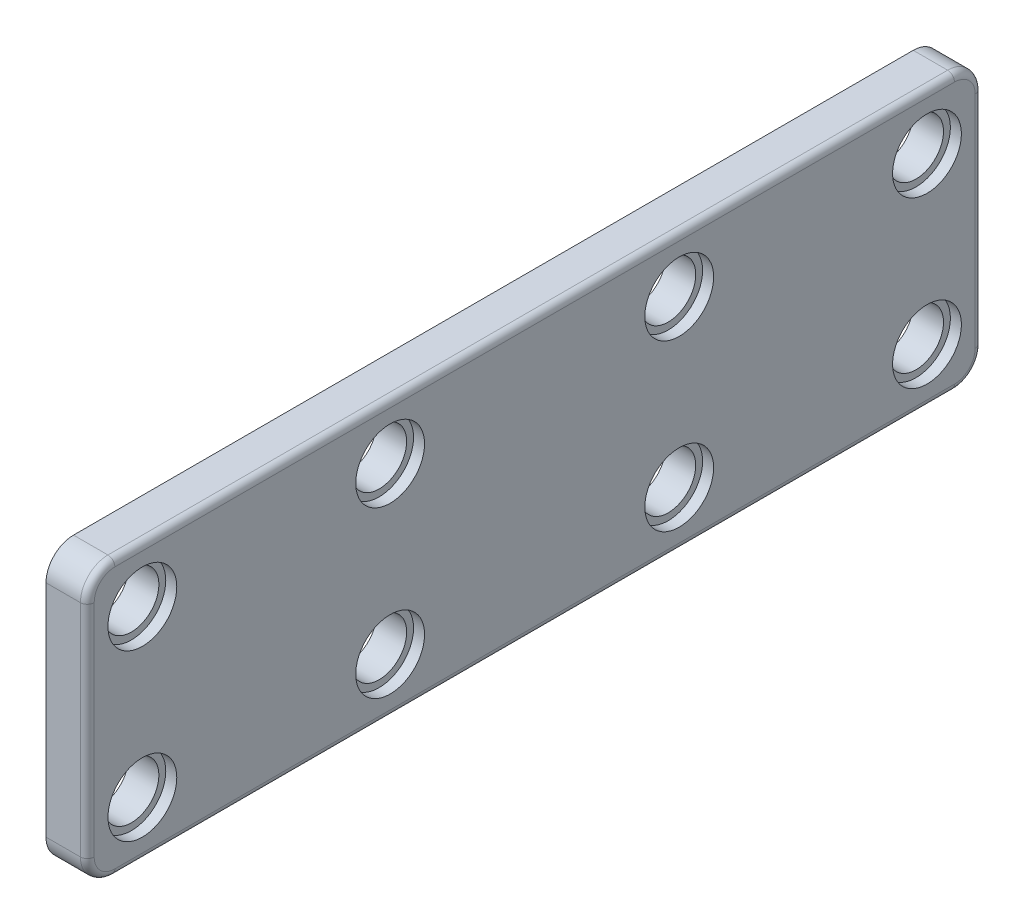
ISO-10303-21;
HEADER;
FILE_DESCRIPTION(('STEP AP214'),'2;1');
FILE_NAME('part.step','',(''),(''),'','','');
FILE_SCHEMA(('AUTOMOTIVE_DESIGN { 1 0 10303 214 1 1 1 1 }'));
ENDSEC;
DATA;
#1=APPLICATION_CONTEXT('core data for automotive mechanical design processes');
#2=APPLICATION_PROTOCOL_DEFINITION('international standard','automotive_design',2000,#1);
#3=PRODUCT_CONTEXT('',#1,'mechanical');
#4=PRODUCT('Part','Part','',(#3));
#5=PRODUCT_RELATED_PRODUCT_CATEGORY('part','',(#4));
#6=PRODUCT_DEFINITION_FORMATION('','',#4);
#7=PRODUCT_DEFINITION_CONTEXT('part definition',#1,'design');
#8=PRODUCT_DEFINITION('design','',#6,#7);
#9=PRODUCT_DEFINITION_SHAPE('','',#8);
#10=(LENGTH_UNIT() NAMED_UNIT(*) SI_UNIT(.MILLI.,.METRE.));
#11=(NAMED_UNIT(*) PLANE_ANGLE_UNIT() SI_UNIT($,.RADIAN.));
#12=(NAMED_UNIT(*) SI_UNIT($,.STERADIAN.) SOLID_ANGLE_UNIT());
#13=UNCERTAINTY_MEASURE_WITH_UNIT(LENGTH_MEASURE(1.E-05),#10,'distance_accuracy_value','');
#14=(GEOMETRIC_REPRESENTATION_CONTEXT(3) GLOBAL_UNCERTAINTY_ASSIGNED_CONTEXT((#13)) GLOBAL_UNIT_ASSIGNED_CONTEXT((#10,
#11,#12)) REPRESENTATION_CONTEXT('',''));
#15=CARTESIAN_POINT('',(0.,0.,0.));
#16=DIRECTION('',(0.,0.,1.));
#17=DIRECTION('',(1.,0.,0.));
#18=AXIS2_PLACEMENT_3D('',#15,#16,#17);
#19=CARTESIAN_POINT('',(1.5,-10.,65.));
#20=DIRECTION('',(-1.,0.,0.));
#21=DIRECTION('',(0.,0.,1.));
#22=AXIS2_PLACEMENT_3D('',#19,#20,#21);
#23=PLANE('',#22);
#24=DIRECTION('',(0.,1.,0.));
#25=VECTOR('',#24,1.);
#26=CARTESIAN_POINT('',(1.5,-10.,64.5));
#27=LINE('',#26,#25);
#28=CARTESIAN_POINT('',(1.5,8.,64.5));
#29=VERTEX_POINT('',#28);
#30=CARTESIAN_POINT('',(1.5,-8.,64.5));
#31=VERTEX_POINT('',#30);
#32=EDGE_CURVE('E232',#29,#31,#27,.F.);
#33=ORIENTED_EDGE('',*,*,#32,.T.);
#34=CARTESIAN_POINT('',(1.5,-8.,63.));
#35=DIRECTION('',(-1.,0.,0.));
#36=DIRECTION('',(0.,0.,1.));
#37=AXIS2_PLACEMENT_3D('',#34,#35,#36);
#38=CIRCLE('',#37,1.5);
#39=CARTESIAN_POINT('',(1.5,-9.5,63.));
#40=VERTEX_POINT('',#39);
#41=EDGE_CURVE('E234',#31,#40,#38,.F.);
#42=ORIENTED_EDGE('',*,*,#41,.T.);
#43=DIRECTION('',(0.,0.,-1.));
#44=VECTOR('',#43,1.);
#45=CARTESIAN_POINT('',(1.5,-9.5,65.));
#46=LINE('',#45,#44);
#47=CARTESIAN_POINT('',(1.5,-9.5,2.));
#48=VERTEX_POINT('',#47);
#49=EDGE_CURVE('E183',#40,#48,#46,.T.);
#50=ORIENTED_EDGE('',*,*,#49,.T.);
#51=CARTESIAN_POINT('',(1.5,-8.,2.));
#52=DIRECTION('',(-1.,0.,0.));
#53=DIRECTION('',(0.,0.,1.));
#54=AXIS2_PLACEMENT_3D('',#51,#52,#53);
#55=CIRCLE('',#54,1.5);
#56=CARTESIAN_POINT('',(1.5,-8.,0.500000000000002));
#57=VERTEX_POINT('',#56);
#58=EDGE_CURVE('E222',#48,#57,#55,.F.);
#59=ORIENTED_EDGE('',*,*,#58,.T.);
#60=DIRECTION('',(0.,1.,0.));
#61=VECTOR('',#60,1.);
#62=CARTESIAN_POINT('',(1.5,8.,0.5));
#63=LINE('',#62,#61);
#64=CARTESIAN_POINT('',(1.5,8.,0.5));
#65=VERTEX_POINT('',#64);
#66=EDGE_CURVE('E224',#57,#65,#63,.T.);
#67=ORIENTED_EDGE('',*,*,#66,.T.);
#68=CARTESIAN_POINT('',(1.5,8.,2.));
#69=DIRECTION('',(-1.,0.,0.));
#70=DIRECTION('',(0.,0.,1.));
#71=AXIS2_PLACEMENT_3D('',#68,#69,#70);
#72=CIRCLE('',#71,1.5);
#73=CARTESIAN_POINT('',(1.5,9.5,2.));
#74=VERTEX_POINT('',#73);
#75=EDGE_CURVE('E226',#65,#74,#72,.F.);
#76=ORIENTED_EDGE('',*,*,#75,.T.);
#77=DIRECTION('',(0.,0.,-1.));
#78=VECTOR('',#77,1.);
#79=CARTESIAN_POINT('',(1.5,9.5,65.));
#80=LINE('',#79,#78);
#81=CARTESIAN_POINT('',(1.5,9.5,63.));
#82=VERTEX_POINT('',#81);
#83=EDGE_CURVE('E228',#74,#82,#80,.F.);
#84=ORIENTED_EDGE('',*,*,#83,.T.);
#85=CARTESIAN_POINT('',(1.5,8.,63.));
#86=DIRECTION('',(-1.,0.,0.));
#87=DIRECTION('',(0.,0.,1.));
#88=AXIS2_PLACEMENT_3D('',#85,#86,#87);
#89=CIRCLE('',#88,1.5);
#90=EDGE_CURVE('E230',#82,#29,#89,.F.);
#91=ORIENTED_EDGE('',*,*,#90,.T.);
#92=EDGE_LOOP('',(#33,#42,#50,#59,#67,#76,#84,#91));
#93=FACE_BOUND('',#92,.T.);
#94=CARTESIAN_POINT('',(1.5,-6.,43.));
#95=DIRECTION('',(1.,0.,0.));
#96=DIRECTION('',(0.,0.,-1.));
#97=AXIS2_PLACEMENT_3D('',#94,#95,#96);
#98=CIRCLE('',#97,2.5);
#99=CARTESIAN_POINT('',(1.5,-6.,40.5));
#100=VERTEX_POINT('',#99);
#101=EDGE_CURVE('E204',#100,#100,#98,.T.);
#102=ORIENTED_EDGE('',*,*,#101,.F.);
#103=EDGE_LOOP('',(#102));
#104=FACE_BOUND('',#103,.T.);
#105=CARTESIAN_POINT('',(1.5,6.,61.));
#106=DIRECTION('',(1.,0.,0.));
#107=DIRECTION('',(0.,0.,-1.));
#108=AXIS2_PLACEMENT_3D('',#105,#106,#107);
#109=CIRCLE('',#108,2.5);
#110=CARTESIAN_POINT('',(1.5,6.,58.5));
#111=VERTEX_POINT('',#110);
#112=EDGE_CURVE('E189',#111,#111,#109,.T.);
#113=ORIENTED_EDGE('',*,*,#112,.F.);
#114=EDGE_LOOP('',(#113));
#115=FACE_BOUND('',#114,.T.);
#116=CARTESIAN_POINT('',(1.5,-6.,61.));
#117=DIRECTION('',(1.,0.,0.));
#118=DIRECTION('',(0.,0.,-1.));
#119=AXIS2_PLACEMENT_3D('',#116,#117,#118);
#120=CIRCLE('',#119,2.5);
#121=CARTESIAN_POINT('',(1.5,-6.,58.5));
#122=VERTEX_POINT('',#121);
#123=EDGE_CURVE('E194',#122,#122,#120,.T.);
#124=ORIENTED_EDGE('',*,*,#123,.F.);
#125=EDGE_LOOP('',(#124));
#126=FACE_BOUND('',#125,.T.);
#127=CARTESIAN_POINT('',(1.5,6.,43.));
#128=DIRECTION('',(1.,0.,0.));
#129=DIRECTION('',(0.,0.,-1.));
#130=AXIS2_PLACEMENT_3D('',#127,#128,#129);
#131=CIRCLE('',#130,2.5);
#132=CARTESIAN_POINT('',(1.5,6.,40.5));
#133=VERTEX_POINT('',#132);
#134=EDGE_CURVE('E199',#133,#133,#131,.T.);
#135=ORIENTED_EDGE('',*,*,#134,.F.);
#136=EDGE_LOOP('',(#135));
#137=FACE_BOUND('',#136,.T.);
#138=CARTESIAN_POINT('',(1.5,6.00000000000001,3.99999999999999));
#139=DIRECTION('',(1.,0.,0.));
#140=DIRECTION('',(0.,0.,-1.));
#141=AXIS2_PLACEMENT_3D('',#138,#139,#140);
#142=CIRCLE('',#141,2.49999999999999);
#143=CARTESIAN_POINT('',(1.5,6.00000000000001,1.5));
#144=VERTEX_POINT('',#143);
#145=EDGE_CURVE('E209',#144,#144,#142,.T.);
#146=ORIENTED_EDGE('',*,*,#145,.F.);
#147=EDGE_LOOP('',(#146));
#148=FACE_BOUND('',#147,.T.);
#149=CARTESIAN_POINT('',(1.5,-5.99999999999999,3.99999999999999));
#150=DIRECTION('',(1.,0.,0.));
#151=DIRECTION('',(0.,0.,-1.));
#152=AXIS2_PLACEMENT_3D('',#149,#150,#151);
#153=CIRCLE('',#152,2.5);
#154=CARTESIAN_POINT('',(1.5,-5.99999999999999,1.49999999999999));
#155=VERTEX_POINT('',#154);
#156=EDGE_CURVE('E214',#155,#155,#153,.T.);
#157=ORIENTED_EDGE('',*,*,#156,.F.);
#158=EDGE_LOOP('',(#157));
#159=FACE_BOUND('',#158,.T.);
#160=CARTESIAN_POINT('',(1.5,6.,22.));
#161=DIRECTION('',(1.,0.,0.));
#162=DIRECTION('',(0.,0.,-1.));
#163=AXIS2_PLACEMENT_3D('',#160,#161,#162);
#164=CIRCLE('',#163,2.5);
#165=CARTESIAN_POINT('',(1.5,6.,19.5));
#166=VERTEX_POINT('',#165);
#167=EDGE_CURVE('E219',#166,#166,#164,.T.);
#168=ORIENTED_EDGE('',*,*,#167,.F.);
#169=EDGE_LOOP('',(#168));
#170=FACE_BOUND('',#169,.T.);
#171=CARTESIAN_POINT('',(1.5,-6.,22.));
#172=DIRECTION('',(1.,0.,0.));
#173=DIRECTION('',(0.,0.,-1.));
#174=AXIS2_PLACEMENT_3D('',#171,#172,#173);
#175=CIRCLE('',#174,2.5);
#176=CARTESIAN_POINT('',(1.5,-6.,19.5));
#177=VERTEX_POINT('',#176);
#178=EDGE_CURVE('E270',#177,#177,#175,.T.);
#179=ORIENTED_EDGE('',*,*,#178,.F.);
#180=EDGE_LOOP('',(#179));
#181=FACE_BOUND('',#180,.T.);
#182=ADVANCED_FACE('F35',(#93,#104,#115,#126,#137,#148,#159,#170,#181),#23,.F.);
#183=CARTESIAN_POINT('',(-1.5,10.,65.));
#184=DIRECTION('',(0.,-1.,0.));
#185=DIRECTION('',(0.,0.,-1.));
#186=AXIS2_PLACEMENT_3D('',#183,#184,#185);
#187=PLANE('',#186);
#188=DIRECTION('',(-1.,0.,0.));
#189=VECTOR('',#188,1.);
#190=CARTESIAN_POINT('',(-1.5,10.,63.));
#191=LINE('',#190,#189);
#192=CARTESIAN_POINT('',(-1.5,10.,63.));
#193=VERTEX_POINT('',#192);
#194=CARTESIAN_POINT('',(1.,10.,63.));
#195=VERTEX_POINT('',#194);
#196=EDGE_CURVE('E143',#193,#195,#191,.F.);
#197=ORIENTED_EDGE('',*,*,#196,.T.);
#198=DIRECTION('',(0.,0.,-1.));
#199=VECTOR('',#198,1.);
#200=CARTESIAN_POINT('',(1.,10.,65.));
#201=LINE('',#200,#199);
#202=CARTESIAN_POINT('',(1.,10.,2.));
#203=VERTEX_POINT('',#202);
#204=EDGE_CURVE('E243',#195,#203,#201,.T.);
#205=ORIENTED_EDGE('',*,*,#204,.T.);
#206=DIRECTION('',(-1.,0.,0.));
#207=VECTOR('',#206,1.);
#208=CARTESIAN_POINT('',(-1.5,10.,2.));
#209=LINE('',#208,#207);
#210=CARTESIAN_POINT('',(-1.5,10.,2.));
#211=VERTEX_POINT('',#210);
#212=EDGE_CURVE('E171',#203,#211,#209,.T.);
#213=ORIENTED_EDGE('',*,*,#212,.T.);
#214=DIRECTION('',(0.,0.,-1.));
#215=VECTOR('',#214,1.);
#216=CARTESIAN_POINT('',(-1.5,10.,65.));
#217=LINE('',#216,#215);
#218=EDGE_CURVE('E138',#193,#211,#217,.T.);
#219=ORIENTED_EDGE('',*,*,#218,.F.);
#220=EDGE_LOOP('',(#197,#205,#213,#219));
#221=FACE_BOUND('',#220,.T.);
#222=ADVANCED_FACE('F352',(#221),#187,.F.);
#223=CARTESIAN_POINT('',(-1.5,-10.,65.));
#224=DIRECTION('',(1.,0.,0.));
#225=DIRECTION('',(0.,0.,-1.));
#226=AXIS2_PLACEMENT_3D('',#223,#224,#225);
#227=PLANE('',#226);
#228=CARTESIAN_POINT('',(-1.5,-6.,22.));
#229=DIRECTION('',(1.,0.,0.));
#230=DIRECTION('',(0.,0.,-1.));
#231=AXIS2_PLACEMENT_3D('',#228,#229,#230);
#232=CIRCLE('',#231,2.);
#233=CARTESIAN_POINT('',(-1.5,-6.,20.));
#234=VERTEX_POINT('',#233);
#235=EDGE_CURVE('E216',#234,#234,#232,.T.);
#236=ORIENTED_EDGE('',*,*,#235,.T.);
#237=EDGE_LOOP('',(#236));
#238=FACE_BOUND('',#237,.T.);
#239=CARTESIAN_POINT('',(-1.5,6.,22.));
#240=DIRECTION('',(1.,0.,0.));
#241=DIRECTION('',(0.,0.,-1.));
#242=AXIS2_PLACEMENT_3D('',#239,#240,#241);
#243=CIRCLE('',#242,2.);
#244=CARTESIAN_POINT('',(-1.5,6.,20.));
#245=VERTEX_POINT('',#244);
#246=EDGE_CURVE('E211',#245,#245,#243,.T.);
#247=ORIENTED_EDGE('',*,*,#246,.T.);
#248=EDGE_LOOP('',(#247));
#249=FACE_BOUND('',#248,.T.);
#250=CARTESIAN_POINT('',(-1.5,-5.99999999999999,3.99999999999999));
#251=DIRECTION('',(1.,0.,0.));
#252=DIRECTION('',(0.,0.,-1.));
#253=AXIS2_PLACEMENT_3D('',#250,#251,#252);
#254=CIRCLE('',#253,2.);
#255=CARTESIAN_POINT('',(-1.5,-5.99999999999999,1.99999999999999));
#256=VERTEX_POINT('',#255);
#257=EDGE_CURVE('E206',#256,#256,#254,.T.);
#258=ORIENTED_EDGE('',*,*,#257,.T.);
#259=EDGE_LOOP('',(#258));
#260=FACE_BOUND('',#259,.T.);
#261=CARTESIAN_POINT('',(-1.5,6.00000000000001,3.99999999999999));
#262=DIRECTION('',(1.,0.,0.));
#263=DIRECTION('',(0.,0.,-1.));
#264=AXIS2_PLACEMENT_3D('',#261,#262,#263);
#265=CIRCLE('',#264,2.);
#266=CARTESIAN_POINT('',(-1.5,6.00000000000001,1.99999999999999));
#267=VERTEX_POINT('',#266);
#268=EDGE_CURVE('E201',#267,#267,#265,.T.);
#269=ORIENTED_EDGE('',*,*,#268,.T.);
#270=EDGE_LOOP('',(#269));
#271=FACE_BOUND('',#270,.T.);
#272=CARTESIAN_POINT('',(-1.5,-6.,43.));
#273=DIRECTION('',(1.,0.,0.));
#274=DIRECTION('',(0.,0.,-1.));
#275=AXIS2_PLACEMENT_3D('',#272,#273,#274);
#276=CIRCLE('',#275,2.);
#277=CARTESIAN_POINT('',(-1.5,-6.,41.));
#278=VERTEX_POINT('',#277);
#279=EDGE_CURVE('E196',#278,#278,#276,.T.);
#280=ORIENTED_EDGE('',*,*,#279,.T.);
#281=EDGE_LOOP('',(#280));
#282=FACE_BOUND('',#281,.T.);
#283=CARTESIAN_POINT('',(-1.5,6.,43.));
#284=DIRECTION('',(1.,0.,0.));
#285=DIRECTION('',(0.,0.,-1.));
#286=AXIS2_PLACEMENT_3D('',#283,#284,#285);
#287=CIRCLE('',#286,2.);
#288=CARTESIAN_POINT('',(-1.5,6.,41.));
#289=VERTEX_POINT('',#288);
#290=EDGE_CURVE('E191',#289,#289,#287,.T.);
#291=ORIENTED_EDGE('',*,*,#290,.T.);
#292=EDGE_LOOP('',(#291));
#293=FACE_BOUND('',#292,.T.);
#294=CARTESIAN_POINT('',(-1.5,-6.,61.));
#295=DIRECTION('',(1.,0.,0.));
#296=DIRECTION('',(0.,0.,-1.));
#297=AXIS2_PLACEMENT_3D('',#294,#295,#296);
#298=CIRCLE('',#297,2.);
#299=CARTESIAN_POINT('',(-1.5,-6.,59.));
#300=VERTEX_POINT('',#299);
#301=EDGE_CURVE('E186',#300,#300,#298,.T.);
#302=ORIENTED_EDGE('',*,*,#301,.T.);
#303=EDGE_LOOP('',(#302));
#304=FACE_BOUND('',#303,.T.);
#305=CARTESIAN_POINT('',(-1.5,6.,61.));
#306=DIRECTION('',(1.,0.,0.));
#307=DIRECTION('',(0.,0.,-1.));
#308=AXIS2_PLACEMENT_3D('',#305,#306,#307);
#309=CIRCLE('',#308,2.);
#310=CARTESIAN_POINT('',(-1.5,6.,59.));
#311=VERTEX_POINT('',#310);
#312=EDGE_CURVE('E158',#311,#311,#309,.T.);
#313=ORIENTED_EDGE('',*,*,#312,.T.);
#314=EDGE_LOOP('',(#313));
#315=FACE_BOUND('',#314,.T.);
#316=DIRECTION('',(0.,-1.,0.));
#317=VECTOR('',#316,1.);
#318=CARTESIAN_POINT('',(-1.5,-10.,0.));
#319=LINE('',#318,#317);
#320=CARTESIAN_POINT('',(-1.5,8.,0.));
#321=VERTEX_POINT('',#320);
#322=CARTESIAN_POINT('',(-1.5,-8.,0.));
#323=VERTEX_POINT('',#322);
#324=EDGE_CURVE('E154',#321,#323,#319,.T.);
#325=ORIENTED_EDGE('',*,*,#324,.T.);
#326=CARTESIAN_POINT('',(-1.5,-8.,2.));
#327=DIRECTION('',(1.,0.,0.));
#328=DIRECTION('',(0.,0.,-1.));
#329=AXIS2_PLACEMENT_3D('',#326,#327,#328);
#330=CIRCLE('',#329,2.);
#331=CARTESIAN_POINT('',(-1.5,-10.,2.));
#332=VERTEX_POINT('',#331);
#333=EDGE_CURVE('E181',#323,#332,#330,.F.);
#334=ORIENTED_EDGE('',*,*,#333,.T.);
#335=DIRECTION('',(0.,0.,-1.));
#336=VECTOR('',#335,1.);
#337=CARTESIAN_POINT('',(-1.5,-10.,65.));
#338=LINE('',#337,#336);
#339=CARTESIAN_POINT('',(-1.5,-10.,63.));
#340=VERTEX_POINT('',#339);
#341=EDGE_CURVE('E153',#340,#332,#338,.T.);
#342=ORIENTED_EDGE('',*,*,#341,.F.);
#343=CARTESIAN_POINT('',(-1.5,-8.,63.));
#344=DIRECTION('',(1.,0.,0.));
#345=DIRECTION('',(0.,0.,-1.));
#346=AXIS2_PLACEMENT_3D('',#343,#344,#345);
#347=CIRCLE('',#346,2.);
#348=CARTESIAN_POINT('',(-1.5,-8.,65.));
#349=VERTEX_POINT('',#348);
#350=EDGE_CURVE('E152',#340,#349,#347,.F.);
#351=ORIENTED_EDGE('',*,*,#350,.T.);
#352=DIRECTION('',(0.,-1.,0.));
#353=VECTOR('',#352,1.);
#354=CARTESIAN_POINT('',(-1.5,-10.,65.));
#355=LINE('',#354,#353);
#356=CARTESIAN_POINT('',(-1.5,8.,65.));
#357=VERTEX_POINT('',#356);
#358=EDGE_CURVE('E131',#357,#349,#355,.T.);
#359=ORIENTED_EDGE('',*,*,#358,.F.);
#360=CARTESIAN_POINT('',(-1.5,8.,63.));
#361=DIRECTION('',(1.,0.,0.));
#362=DIRECTION('',(0.,0.,-1.));
#363=AXIS2_PLACEMENT_3D('',#360,#361,#362);
#364=CIRCLE('',#363,2.);
#365=EDGE_CURVE('E137',#357,#193,#364,.F.);
#366=ORIENTED_EDGE('',*,*,#365,.T.);
#367=ORIENTED_EDGE('',*,*,#218,.T.);
#368=CARTESIAN_POINT('',(-1.5,8.,2.));
#369=DIRECTION('',(1.,0.,0.));
#370=DIRECTION('',(0.,0.,-1.));
#371=AXIS2_PLACEMENT_3D('',#368,#369,#370);
#372=CIRCLE('',#371,2.);
#373=EDGE_CURVE('E173',#211,#321,#372,.F.);
#374=ORIENTED_EDGE('',*,*,#373,.T.);
#375=EDGE_LOOP('',(#325,#334,#342,#351,#359,#366,#367,#374));
#376=FACE_BOUND('',#375,.T.);
#377=ADVANCED_FACE('F149',(#238,#249,#260,#271,#282,#293,#304,#315,#376),#227,.F.);
#378=CARTESIAN_POINT('',(-1.5,-10.,65.));
#379=DIRECTION('',(0.,1.,0.));
#380=DIRECTION('',(0.,0.,1.));
#381=AXIS2_PLACEMENT_3D('',#378,#379,#380);
#382=PLANE('',#381);
#383=DIRECTION('',(1.,0.,0.));
#384=VECTOR('',#383,1.);
#385=CARTESIAN_POINT('',(1.5,-10.,2.));
#386=LINE('',#385,#384);
#387=CARTESIAN_POINT('',(1.,-10.,2.));
#388=VERTEX_POINT('',#387);
#389=EDGE_CURVE('E177',#332,#388,#386,.T.);
#390=ORIENTED_EDGE('',*,*,#389,.T.);
#391=DIRECTION('',(0.,0.,-1.));
#392=VECTOR('',#391,1.);
#393=CARTESIAN_POINT('',(1.,-10.,65.));
#394=LINE('',#393,#392);
#395=CARTESIAN_POINT('',(1.,-10.,63.));
#396=VERTEX_POINT('',#395);
#397=EDGE_CURVE('E11',#388,#396,#394,.F.);
#398=ORIENTED_EDGE('',*,*,#397,.T.);
#399=DIRECTION('',(1.,0.,0.));
#400=VECTOR('',#399,1.);
#401=CARTESIAN_POINT('',(-1.5,-10.,63.));
#402=LINE('',#401,#400);
#403=EDGE_CURVE('E168',#396,#340,#402,.F.);
#404=ORIENTED_EDGE('',*,*,#403,.T.);
#405=ORIENTED_EDGE('',*,*,#341,.T.);
#406=EDGE_LOOP('',(#390,#398,#404,#405));
#407=FACE_BOUND('',#406,.T.);
#408=ADVANCED_FACE('F421',(#407),#382,.F.);
#409=CARTESIAN_POINT('',(0.,0.,65.));
#410=DIRECTION('',(0.,0.,-1.));
#411=DIRECTION('',(-1.,0.,0.));
#412=AXIS2_PLACEMENT_3D('',#409,#410,#411);
#413=PLANE('',#412);
#414=DIRECTION('',(1.,0.,0.));
#415=VECTOR('',#414,1.);
#416=CARTESIAN_POINT('',(0.,-8.,65.));
#417=LINE('',#416,#415);
#418=CARTESIAN_POINT('',(1.,-8.,65.));
#419=VERTEX_POINT('',#418);
#420=EDGE_CURVE('E166',#349,#419,#417,.T.);
#421=ORIENTED_EDGE('',*,*,#420,.T.);
#422=DIRECTION('',(0.,1.,0.));
#423=VECTOR('',#422,1.);
#424=CARTESIAN_POINT('',(1.,0.,65.));
#425=LINE('',#424,#423);
#426=CARTESIAN_POINT('',(1.,8.,65.));
#427=VERTEX_POINT('',#426);
#428=EDGE_CURVE('E134',#419,#427,#425,.T.);
#429=ORIENTED_EDGE('',*,*,#428,.T.);
#430=DIRECTION('',(-1.,0.,0.));
#431=VECTOR('',#430,1.);
#432=CARTESIAN_POINT('',(0.,8.,65.));
#433=LINE('',#432,#431);
#434=EDGE_CURVE('E126',#427,#357,#433,.T.);
#435=ORIENTED_EDGE('',*,*,#434,.T.);
#436=ORIENTED_EDGE('',*,*,#358,.T.);
#437=EDGE_LOOP('',(#421,#429,#435,#436));
#438=FACE_BOUND('',#437,.T.);
#439=ADVANCED_FACE('F129',(#438),#413,.F.);
#440=CARTESIAN_POINT('',(0.,0.,0.));
#441=DIRECTION('',(0.,0.,-1.));
#442=DIRECTION('',(-1.,0.,0.));
#443=AXIS2_PLACEMENT_3D('',#440,#441,#442);
#444=PLANE('',#443);
#445=DIRECTION('',(-1.,0.,0.));
#446=VECTOR('',#445,1.);
#447=CARTESIAN_POINT('',(1.5,8.,0.));
#448=LINE('',#447,#446);
#449=CARTESIAN_POINT('',(1.,8.,0.));
#450=VERTEX_POINT('',#449);
#451=EDGE_CURVE('E175',#321,#450,#448,.F.);
#452=ORIENTED_EDGE('',*,*,#451,.T.);
#453=DIRECTION('',(0.,1.,0.));
#454=VECTOR('',#453,1.);
#455=CARTESIAN_POINT('',(1.,-8.,0.));
#456=LINE('',#455,#454);
#457=CARTESIAN_POINT('',(1.,-8.,0.));
#458=VERTEX_POINT('',#457);
#459=EDGE_CURVE('E59',#450,#458,#456,.F.);
#460=ORIENTED_EDGE('',*,*,#459,.T.);
#461=DIRECTION('',(1.,0.,0.));
#462=VECTOR('',#461,1.);
#463=CARTESIAN_POINT('',(-1.5,-8.,0.));
#464=LINE('',#463,#462);
#465=EDGE_CURVE('E179',#458,#323,#464,.F.);
#466=ORIENTED_EDGE('',*,*,#465,.T.);
#467=ORIENTED_EDGE('',*,*,#324,.F.);
#468=EDGE_LOOP('',(#452,#460,#466,#467));
#469=FACE_BOUND('',#468,.T.);
#470=ADVANCED_FACE('F366',(#469),#444,.T.);
#471=CARTESIAN_POINT('',(0.,8.,63.));
#472=DIRECTION('',(-1.,0.,0.));
#473=DIRECTION('',(0.,0.,1.));
#474=AXIS2_PLACEMENT_3D('',#471,#472,#473);
#475=CYLINDRICAL_SURFACE('',#474,2.);
#476=ORIENTED_EDGE('',*,*,#434,.F.);
#477=CARTESIAN_POINT('',(1.,8.,63.));
#478=DIRECTION('',(-1.,0.,0.));
#479=DIRECTION('',(0.,0.,1.));
#480=AXIS2_PLACEMENT_3D('',#477,#478,#479);
#481=CIRCLE('',#480,2.);
#482=EDGE_CURVE('E241',#427,#195,#481,.T.);
#483=ORIENTED_EDGE('',*,*,#482,.T.);
#484=ORIENTED_EDGE('',*,*,#196,.F.);
#485=ORIENTED_EDGE('',*,*,#365,.F.);
#486=EDGE_LOOP('',(#476,#483,#484,#485));
#487=FACE_BOUND('',#486,.T.);
#488=ADVANCED_FACE('F141',(#487),#475,.T.);
#489=CARTESIAN_POINT('',(0.,-8.,63.));
#490=DIRECTION('',(1.,0.,0.));
#491=DIRECTION('',(0.,0.,-1.));
#492=AXIS2_PLACEMENT_3D('',#489,#490,#491);
#493=CYLINDRICAL_SURFACE('',#492,2.);
#494=ORIENTED_EDGE('',*,*,#403,.F.);
#495=CARTESIAN_POINT('',(1.,-8.,63.));
#496=DIRECTION('',(-1.,0.,0.));
#497=DIRECTION('',(0.,0.,1.));
#498=AXIS2_PLACEMENT_3D('',#495,#496,#497);
#499=CIRCLE('',#498,2.);
#500=EDGE_CURVE('E237',#396,#419,#499,.T.);
#501=ORIENTED_EDGE('',*,*,#500,.T.);
#502=ORIENTED_EDGE('',*,*,#420,.F.);
#503=ORIENTED_EDGE('',*,*,#350,.F.);
#504=EDGE_LOOP('',(#494,#501,#502,#503));
#505=FACE_BOUND('',#504,.T.);
#506=ADVANCED_FACE('F365',(#505),#493,.T.);
#507=CARTESIAN_POINT('',(-1.5,8.,2.));
#508=DIRECTION('',(1.,0.,0.));
#509=DIRECTION('',(0.,0.,-1.));
#510=AXIS2_PLACEMENT_3D('',#507,#508,#509);
#511=CYLINDRICAL_SURFACE('',#510,2.);
#512=ORIENTED_EDGE('',*,*,#212,.F.);
#513=CARTESIAN_POINT('',(1.,8.,2.));
#514=DIRECTION('',(-1.,0.,0.));
#515=DIRECTION('',(0.,0.,1.));
#516=AXIS2_PLACEMENT_3D('',#513,#514,#515);
#517=CIRCLE('',#516,2.);
#518=EDGE_CURVE('E245',#203,#450,#517,.T.);
#519=ORIENTED_EDGE('',*,*,#518,.T.);
#520=ORIENTED_EDGE('',*,*,#451,.F.);
#521=ORIENTED_EDGE('',*,*,#373,.F.);
#522=EDGE_LOOP('',(#512,#519,#520,#521));
#523=FACE_BOUND('',#522,.T.);
#524=ADVANCED_FACE('F369',(#523),#511,.T.);
#525=CARTESIAN_POINT('',(-1.5,-8.,2.));
#526=DIRECTION('',(-1.,0.,0.));
#527=DIRECTION('',(0.,0.,1.));
#528=AXIS2_PLACEMENT_3D('',#525,#526,#527);
#529=CYLINDRICAL_SURFACE('',#528,2.);
#530=ORIENTED_EDGE('',*,*,#465,.F.);
#531=CARTESIAN_POINT('',(1.,-8.,2.));
#532=DIRECTION('',(-1.,0.,0.));
#533=DIRECTION('',(0.,0.,1.));
#534=AXIS2_PLACEMENT_3D('',#531,#532,#533);
#535=CIRCLE('',#534,2.);
#536=EDGE_CURVE('E44',#458,#388,#535,.T.);
#537=ORIENTED_EDGE('',*,*,#536,.T.);
#538=ORIENTED_EDGE('',*,*,#389,.F.);
#539=ORIENTED_EDGE('',*,*,#333,.F.);
#540=EDGE_LOOP('',(#530,#537,#538,#539));
#541=FACE_BOUND('',#540,.T.);
#542=ADVANCED_FACE('F349',(#541),#529,.T.);
#543=CARTESIAN_POINT('',(1.5,6.,61.));
#544=DIRECTION('',(1.,0.,0.));
#545=DIRECTION('',(0.,0.,-1.));
#546=AXIS2_PLACEMENT_3D('',#543,#544,#545);
#547=CYLINDRICAL_SURFACE('',#546,2.);
#548=CARTESIAN_POINT('',(0.700000000000001,6.,61.));
#549=DIRECTION('',(1.,0.,0.));
#550=DIRECTION('',(0.,0.,-1.));
#551=AXIS2_PLACEMENT_3D('',#548,#549,#550);
#552=CIRCLE('',#551,2.);
#553=CARTESIAN_POINT('',(0.700000000000001,6.,59.));
#554=VERTEX_POINT('',#553);
#555=EDGE_CURVE('E161',#554,#554,#552,.T.);
#556=ORIENTED_EDGE('',*,*,#555,.T.);
#557=EDGE_LOOP('',(#556));
#558=FACE_BOUND('',#557,.T.);
#559=ORIENTED_EDGE('',*,*,#312,.F.);
#560=EDGE_LOOP('',(#559));
#561=FACE_BOUND('',#560,.T.);
#562=ADVANCED_FACE('F335',(#558,#561),#547,.F.);
#563=CARTESIAN_POINT('',(0.700000000000001,8.,61.));
#564=DIRECTION('',(-1.,0.,0.));
#565=DIRECTION('',(0.,0.,1.));
#566=AXIS2_PLACEMENT_3D('',#563,#564,#565);
#567=PLANE('',#566);
#568=ORIENTED_EDGE('',*,*,#555,.F.);
#569=EDGE_LOOP('',(#568));
#570=FACE_BOUND('',#569,.T.);
#571=CARTESIAN_POINT('',(0.700000000000001,6.,61.));
#572=DIRECTION('',(1.,0.,0.));
#573=DIRECTION('',(0.,0.,-1.));
#574=AXIS2_PLACEMENT_3D('',#571,#572,#573);
#575=CIRCLE('',#574,2.5);
#576=CARTESIAN_POINT('',(0.700000000000001,6.,58.5));
#577=VERTEX_POINT('',#576);
#578=EDGE_CURVE('E328',#577,#577,#575,.T.);
#579=ORIENTED_EDGE('',*,*,#578,.T.);
#580=EDGE_LOOP('',(#579));
#581=FACE_BOUND('',#580,.T.);
#582=ADVANCED_FACE('F338',(#570,#581),#567,.F.);
#583=CARTESIAN_POINT('',(1.5,6.,61.));
#584=DIRECTION('',(1.,0.,0.));
#585=DIRECTION('',(0.,0.,-1.));
#586=AXIS2_PLACEMENT_3D('',#583,#584,#585);
#587=CYLINDRICAL_SURFACE('',#586,2.5);
#588=ORIENTED_EDGE('',*,*,#578,.F.);
#589=EDGE_LOOP('',(#588));
#590=FACE_BOUND('',#589,.T.);
#591=ORIENTED_EDGE('',*,*,#112,.T.);
#592=EDGE_LOOP('',(#591));
#593=FACE_BOUND('',#592,.T.);
#594=ADVANCED_FACE('F340',(#590,#593),#587,.F.);
#595=CARTESIAN_POINT('',(1.5,-6.,61.));
#596=DIRECTION('',(1.,0.,0.));
#597=DIRECTION('',(0.,0.,-1.));
#598=AXIS2_PLACEMENT_3D('',#595,#596,#597);
#599=CYLINDRICAL_SURFACE('',#598,2.);
#600=CARTESIAN_POINT('',(0.700000000000001,-6.,61.));
#601=DIRECTION('',(1.,0.,0.));
#602=DIRECTION('',(0.,0.,-1.));
#603=AXIS2_PLACEMENT_3D('',#600,#601,#602);
#604=CIRCLE('',#603,2.);
#605=CARTESIAN_POINT('',(0.700000000000001,-6.,59.));
#606=VERTEX_POINT('',#605);
#607=EDGE_CURVE('E190',#606,#606,#604,.T.);
#608=ORIENTED_EDGE('',*,*,#607,.T.);
#609=EDGE_LOOP('',(#608));
#610=FACE_BOUND('',#609,.T.);
#611=ORIENTED_EDGE('',*,*,#301,.F.);
#612=EDGE_LOOP('',(#611));
#613=FACE_BOUND('',#612,.T.);
#614=ADVANCED_FACE('F346',(#610,#613),#599,.F.);
#615=CARTESIAN_POINT('',(0.700000000000001,-4.,61.));
#616=DIRECTION('',(-1.,0.,0.));
#617=DIRECTION('',(0.,0.,1.));
#618=AXIS2_PLACEMENT_3D('',#615,#616,#617);
#619=PLANE('',#618);
#620=ORIENTED_EDGE('',*,*,#607,.F.);
#621=EDGE_LOOP('',(#620));
#622=FACE_BOUND('',#621,.T.);
#623=CARTESIAN_POINT('',(0.700000000000001,-6.,61.));
#624=DIRECTION('',(1.,0.,0.));
#625=DIRECTION('',(0.,0.,-1.));
#626=AXIS2_PLACEMENT_3D('',#623,#624,#625);
#627=CIRCLE('',#626,2.5);
#628=CARTESIAN_POINT('',(0.700000000000001,-6.,58.5));
#629=VERTEX_POINT('',#628);
#630=EDGE_CURVE('E322',#629,#629,#627,.T.);
#631=ORIENTED_EDGE('',*,*,#630,.T.);
#632=EDGE_LOOP('',(#631));
#633=FACE_BOUND('',#632,.T.);
#634=ADVANCED_FACE('F463',(#622,#633),#619,.F.);
#635=CARTESIAN_POINT('',(1.5,-6.,61.));
#636=DIRECTION('',(1.,0.,0.));
#637=DIRECTION('',(0.,0.,-1.));
#638=AXIS2_PLACEMENT_3D('',#635,#636,#637);
#639=CYLINDRICAL_SURFACE('',#638,2.5);
#640=ORIENTED_EDGE('',*,*,#630,.F.);
#641=EDGE_LOOP('',(#640));
#642=FACE_BOUND('',#641,.T.);
#643=ORIENTED_EDGE('',*,*,#123,.T.);
#644=EDGE_LOOP('',(#643));
#645=FACE_BOUND('',#644,.T.);
#646=ADVANCED_FACE('F469',(#642,#645),#639,.F.);
#647=CARTESIAN_POINT('',(1.5,6.,43.));
#648=DIRECTION('',(1.,0.,0.));
#649=DIRECTION('',(0.,0.,-1.));
#650=AXIS2_PLACEMENT_3D('',#647,#648,#649);
#651=CYLINDRICAL_SURFACE('',#650,2.);
#652=CARTESIAN_POINT('',(0.700000000000001,6.,43.));
#653=DIRECTION('',(1.,0.,0.));
#654=DIRECTION('',(0.,0.,-1.));
#655=AXIS2_PLACEMENT_3D('',#652,#653,#654);
#656=CIRCLE('',#655,2.);
#657=CARTESIAN_POINT('',(0.700000000000001,6.,41.));
#658=VERTEX_POINT('',#657);
#659=EDGE_CURVE('E195',#658,#658,#656,.T.);
#660=ORIENTED_EDGE('',*,*,#659,.T.);
#661=EDGE_LOOP('',(#660));
#662=FACE_BOUND('',#661,.T.);
#663=ORIENTED_EDGE('',*,*,#290,.F.);
#664=EDGE_LOOP('',(#663));
#665=FACE_BOUND('',#664,.T.);
#666=ADVANCED_FACE('F475',(#662,#665),#651,.F.);
#667=CARTESIAN_POINT('',(0.700000000000001,8.,43.));
#668=DIRECTION('',(-1.,0.,0.));
#669=DIRECTION('',(0.,0.,1.));
#670=AXIS2_PLACEMENT_3D('',#667,#668,#669);
#671=PLANE('',#670);
#672=ORIENTED_EDGE('',*,*,#659,.F.);
#673=EDGE_LOOP('',(#672));
#674=FACE_BOUND('',#673,.T.);
#675=CARTESIAN_POINT('',(0.700000000000001,6.,43.));
#676=DIRECTION('',(1.,0.,0.));
#677=DIRECTION('',(0.,0.,-1.));
#678=AXIS2_PLACEMENT_3D('',#675,#676,#677);
#679=CIRCLE('',#678,2.5);
#680=CARTESIAN_POINT('',(0.700000000000001,6.,40.5));
#681=VERTEX_POINT('',#680);
#682=EDGE_CURVE('E315',#681,#681,#679,.T.);
#683=ORIENTED_EDGE('',*,*,#682,.T.);
#684=EDGE_LOOP('',(#683));
#685=FACE_BOUND('',#684,.T.);
#686=ADVANCED_FACE('F479',(#674,#685),#671,.F.);
#687=CARTESIAN_POINT('',(1.5,6.,43.));
#688=DIRECTION('',(1.,0.,0.));
#689=DIRECTION('',(0.,0.,-1.));
#690=AXIS2_PLACEMENT_3D('',#687,#688,#689);
#691=CYLINDRICAL_SURFACE('',#690,2.5);
#692=ORIENTED_EDGE('',*,*,#682,.F.);
#693=EDGE_LOOP('',(#692));
#694=FACE_BOUND('',#693,.T.);
#695=ORIENTED_EDGE('',*,*,#134,.T.);
#696=EDGE_LOOP('',(#695));
#697=FACE_BOUND('',#696,.T.);
#698=ADVANCED_FACE('F483',(#694,#697),#691,.F.);
#699=CARTESIAN_POINT('',(1.5,-6.,43.));
#700=DIRECTION('',(1.,0.,0.));
#701=DIRECTION('',(0.,0.,-1.));
#702=AXIS2_PLACEMENT_3D('',#699,#700,#701);
#703=CYLINDRICAL_SURFACE('',#702,2.);
#704=CARTESIAN_POINT('',(0.700000000000001,-6.,43.));
#705=DIRECTION('',(1.,0.,0.));
#706=DIRECTION('',(0.,0.,-1.));
#707=AXIS2_PLACEMENT_3D('',#704,#705,#706);
#708=CIRCLE('',#707,2.);
#709=CARTESIAN_POINT('',(0.700000000000001,-6.,41.));
#710=VERTEX_POINT('',#709);
#711=EDGE_CURVE('E200',#710,#710,#708,.T.);
#712=ORIENTED_EDGE('',*,*,#711,.T.);
#713=EDGE_LOOP('',(#712));
#714=FACE_BOUND('',#713,.T.);
#715=ORIENTED_EDGE('',*,*,#279,.F.);
#716=EDGE_LOOP('',(#715));
#717=FACE_BOUND('',#716,.T.);
#718=ADVANCED_FACE('F487',(#714,#717),#703,.F.);
#719=CARTESIAN_POINT('',(0.700000000000001,-4.,43.));
#720=DIRECTION('',(-1.,0.,0.));
#721=DIRECTION('',(0.,0.,1.));
#722=AXIS2_PLACEMENT_3D('',#719,#720,#721);
#723=PLANE('',#722);
#724=ORIENTED_EDGE('',*,*,#711,.F.);
#725=EDGE_LOOP('',(#724));
#726=FACE_BOUND('',#725,.T.);
#727=CARTESIAN_POINT('',(0.700000000000001,-6.,43.));
#728=DIRECTION('',(1.,0.,0.));
#729=DIRECTION('',(0.,0.,-1.));
#730=AXIS2_PLACEMENT_3D('',#727,#728,#729);
#731=CIRCLE('',#730,2.5);
#732=CARTESIAN_POINT('',(0.700000000000001,-6.,40.5));
#733=VERTEX_POINT('',#732);
#734=EDGE_CURVE('E308',#733,#733,#731,.T.);
#735=ORIENTED_EDGE('',*,*,#734,.T.);
#736=EDGE_LOOP('',(#735));
#737=FACE_BOUND('',#736,.T.);
#738=ADVANCED_FACE('F491',(#726,#737),#723,.F.);
#739=CARTESIAN_POINT('',(1.5,-6.,43.));
#740=DIRECTION('',(1.,0.,0.));
#741=DIRECTION('',(0.,0.,-1.));
#742=AXIS2_PLACEMENT_3D('',#739,#740,#741);
#743=CYLINDRICAL_SURFACE('',#742,2.5);
#744=ORIENTED_EDGE('',*,*,#734,.F.);
#745=EDGE_LOOP('',(#744));
#746=FACE_BOUND('',#745,.T.);
#747=ORIENTED_EDGE('',*,*,#101,.T.);
#748=EDGE_LOOP('',(#747));
#749=FACE_BOUND('',#748,.T.);
#750=ADVANCED_FACE('F495',(#746,#749),#743,.F.);
#751=CARTESIAN_POINT('',(1.5,6.00000000000001,3.99999999999999));
#752=DIRECTION('',(1.,0.,0.));
#753=DIRECTION('',(0.,0.,-1.));
#754=AXIS2_PLACEMENT_3D('',#751,#752,#753);
#755=CYLINDRICAL_SURFACE('',#754,2.);
#756=CARTESIAN_POINT('',(0.700000000000001,6.00000000000001,3.99999999999999));
#757=DIRECTION('',(1.,0.,0.));
#758=DIRECTION('',(0.,0.,-1.));
#759=AXIS2_PLACEMENT_3D('',#756,#757,#758);
#760=CIRCLE('',#759,2.);
#761=CARTESIAN_POINT('',(0.700000000000001,6.00000000000001,1.99999999999999));
#762=VERTEX_POINT('',#761);
#763=EDGE_CURVE('E205',#762,#762,#760,.T.);
#764=ORIENTED_EDGE('',*,*,#763,.T.);
#765=EDGE_LOOP('',(#764));
#766=FACE_BOUND('',#765,.T.);
#767=ORIENTED_EDGE('',*,*,#268,.F.);
#768=EDGE_LOOP('',(#767));
#769=FACE_BOUND('',#768,.T.);
#770=ADVANCED_FACE('F499',(#766,#769),#755,.F.);
#771=CARTESIAN_POINT('',(0.700000000000001,8.00000000000001,3.99999999999999));
#772=DIRECTION('',(-1.,0.,0.));
#773=DIRECTION('',(0.,0.,1.));
#774=AXIS2_PLACEMENT_3D('',#771,#772,#773);
#775=PLANE('',#774);
#776=ORIENTED_EDGE('',*,*,#763,.F.);
#777=EDGE_LOOP('',(#776));
#778=FACE_BOUND('',#777,.T.);
#779=CARTESIAN_POINT('',(0.700000000000001,6.00000000000001,3.99999999999999));
#780=DIRECTION('',(1.,0.,0.));
#781=DIRECTION('',(0.,0.,-1.));
#782=AXIS2_PLACEMENT_3D('',#779,#780,#781);
#783=CIRCLE('',#782,2.5);
#784=CARTESIAN_POINT('',(0.700000000000001,6.00000000000001,1.49999999999999));
#785=VERTEX_POINT('',#784);
#786=EDGE_CURVE('E301',#785,#785,#783,.T.);
#787=ORIENTED_EDGE('',*,*,#786,.T.);
#788=EDGE_LOOP('',(#787));
#789=FACE_BOUND('',#788,.T.);
#790=ADVANCED_FACE('F503',(#778,#789),#775,.F.);
#791=CARTESIAN_POINT('',(1.5,6.00000000000001,3.99999999999999));
#792=DIRECTION('',(1.,0.,0.));
#793=DIRECTION('',(0.,0.,-1.));
#794=AXIS2_PLACEMENT_3D('',#791,#792,#793);
#795=CYLINDRICAL_SURFACE('',#794,2.5);
#796=ORIENTED_EDGE('',*,*,#786,.F.);
#797=EDGE_LOOP('',(#796));
#798=FACE_BOUND('',#797,.T.);
#799=ORIENTED_EDGE('',*,*,#145,.T.);
#800=EDGE_LOOP('',(#799));
#801=FACE_BOUND('',#800,.T.);
#802=ADVANCED_FACE('F507',(#798,#801),#795,.F.);
#803=CARTESIAN_POINT('',(1.5,-5.99999999999999,3.99999999999999));
#804=DIRECTION('',(1.,0.,0.));
#805=DIRECTION('',(0.,0.,-1.));
#806=AXIS2_PLACEMENT_3D('',#803,#804,#805);
#807=CYLINDRICAL_SURFACE('',#806,2.);
#808=CARTESIAN_POINT('',(0.700000000000001,-5.99999999999999,3.99999999999999));
#809=DIRECTION('',(1.,0.,0.));
#810=DIRECTION('',(0.,0.,-1.));
#811=AXIS2_PLACEMENT_3D('',#808,#809,#810);
#812=CIRCLE('',#811,2.);
#813=CARTESIAN_POINT('',(0.700000000000001,-5.99999999999999,1.99999999999999));
#814=VERTEX_POINT('',#813);
#815=EDGE_CURVE('E210',#814,#814,#812,.T.);
#816=ORIENTED_EDGE('',*,*,#815,.T.);
#817=EDGE_LOOP('',(#816));
#818=FACE_BOUND('',#817,.T.);
#819=ORIENTED_EDGE('',*,*,#257,.F.);
#820=EDGE_LOOP('',(#819));
#821=FACE_BOUND('',#820,.T.);
#822=ADVANCED_FACE('F511',(#818,#821),#807,.F.);
#823=CARTESIAN_POINT('',(0.700000000000001,-3.99999999999999,3.99999999999999));
#824=DIRECTION('',(-1.,0.,0.));
#825=DIRECTION('',(0.,0.,1.));
#826=AXIS2_PLACEMENT_3D('',#823,#824,#825);
#827=PLANE('',#826);
#828=ORIENTED_EDGE('',*,*,#815,.F.);
#829=EDGE_LOOP('',(#828));
#830=FACE_BOUND('',#829,.T.);
#831=CARTESIAN_POINT('',(0.700000000000001,-5.99999999999999,3.99999999999999));
#832=DIRECTION('',(1.,0.,0.));
#833=DIRECTION('',(0.,0.,-1.));
#834=AXIS2_PLACEMENT_3D('',#831,#832,#833);
#835=CIRCLE('',#834,2.5);
#836=CARTESIAN_POINT('',(0.700000000000001,-5.99999999999999,1.49999999999999));
#837=VERTEX_POINT('',#836);
#838=EDGE_CURVE('E294',#837,#837,#835,.T.);
#839=ORIENTED_EDGE('',*,*,#838,.T.);
#840=EDGE_LOOP('',(#839));
#841=FACE_BOUND('',#840,.T.);
#842=ADVANCED_FACE('F515',(#830,#841),#827,.F.);
#843=CARTESIAN_POINT('',(1.5,-5.99999999999999,3.99999999999999));
#844=DIRECTION('',(1.,0.,0.));
#845=DIRECTION('',(0.,0.,-1.));
#846=AXIS2_PLACEMENT_3D('',#843,#844,#845);
#847=CYLINDRICAL_SURFACE('',#846,2.5);
#848=ORIENTED_EDGE('',*,*,#838,.F.);
#849=EDGE_LOOP('',(#848));
#850=FACE_BOUND('',#849,.T.);
#851=ORIENTED_EDGE('',*,*,#156,.T.);
#852=EDGE_LOOP('',(#851));
#853=FACE_BOUND('',#852,.T.);
#854=ADVANCED_FACE('F519',(#850,#853),#847,.F.);
#855=CARTESIAN_POINT('',(1.5,6.,22.));
#856=DIRECTION('',(1.,0.,0.));
#857=DIRECTION('',(0.,0.,-1.));
#858=AXIS2_PLACEMENT_3D('',#855,#856,#857);
#859=CYLINDRICAL_SURFACE('',#858,2.);
#860=CARTESIAN_POINT('',(0.700000000000001,6.,22.));
#861=DIRECTION('',(1.,0.,0.));
#862=DIRECTION('',(0.,0.,-1.));
#863=AXIS2_PLACEMENT_3D('',#860,#861,#862);
#864=CIRCLE('',#863,2.);
#865=CARTESIAN_POINT('',(0.700000000000001,6.,20.));
#866=VERTEX_POINT('',#865);
#867=EDGE_CURVE('E215',#866,#866,#864,.T.);
#868=ORIENTED_EDGE('',*,*,#867,.T.);
#869=EDGE_LOOP('',(#868));
#870=FACE_BOUND('',#869,.T.);
#871=ORIENTED_EDGE('',*,*,#246,.F.);
#872=EDGE_LOOP('',(#871));
#873=FACE_BOUND('',#872,.T.);
#874=ADVANCED_FACE('F523',(#870,#873),#859,.F.);
#875=CARTESIAN_POINT('',(0.700000000000001,8.,22.));
#876=DIRECTION('',(-1.,0.,0.));
#877=DIRECTION('',(0.,0.,1.));
#878=AXIS2_PLACEMENT_3D('',#875,#876,#877);
#879=PLANE('',#878);
#880=ORIENTED_EDGE('',*,*,#867,.F.);
#881=EDGE_LOOP('',(#880));
#882=FACE_BOUND('',#881,.T.);
#883=CARTESIAN_POINT('',(0.700000000000001,6.,22.));
#884=DIRECTION('',(1.,0.,0.));
#885=DIRECTION('',(0.,0.,-1.));
#886=AXIS2_PLACEMENT_3D('',#883,#884,#885);
#887=CIRCLE('',#886,2.5);
#888=CARTESIAN_POINT('',(0.700000000000001,6.,19.5));
#889=VERTEX_POINT('',#888);
#890=EDGE_CURVE('E287',#889,#889,#887,.T.);
#891=ORIENTED_EDGE('',*,*,#890,.T.);
#892=EDGE_LOOP('',(#891));
#893=FACE_BOUND('',#892,.T.);
#894=ADVANCED_FACE('F527',(#882,#893),#879,.F.);
#895=CARTESIAN_POINT('',(1.5,6.,22.));
#896=DIRECTION('',(1.,0.,0.));
#897=DIRECTION('',(0.,0.,-1.));
#898=AXIS2_PLACEMENT_3D('',#895,#896,#897);
#899=CYLINDRICAL_SURFACE('',#898,2.5);
#900=ORIENTED_EDGE('',*,*,#890,.F.);
#901=EDGE_LOOP('',(#900));
#902=FACE_BOUND('',#901,.T.);
#903=ORIENTED_EDGE('',*,*,#167,.T.);
#904=EDGE_LOOP('',(#903));
#905=FACE_BOUND('',#904,.T.);
#906=ADVANCED_FACE('F531',(#902,#905),#899,.F.);
#907=CARTESIAN_POINT('',(1.5,-6.,22.));
#908=DIRECTION('',(1.,0.,0.));
#909=DIRECTION('',(0.,0.,-1.));
#910=AXIS2_PLACEMENT_3D('',#907,#908,#909);
#911=CYLINDRICAL_SURFACE('',#910,2.);
#912=CARTESIAN_POINT('',(0.700000000000001,-6.,22.));
#913=DIRECTION('',(1.,0.,0.));
#914=DIRECTION('',(0.,0.,-1.));
#915=AXIS2_PLACEMENT_3D('',#912,#913,#914);
#916=CIRCLE('',#915,2.);
#917=CARTESIAN_POINT('',(0.700000000000001,-6.,20.));
#918=VERTEX_POINT('',#917);
#919=EDGE_CURVE('E220',#918,#918,#916,.T.);
#920=ORIENTED_EDGE('',*,*,#919,.T.);
#921=EDGE_LOOP('',(#920));
#922=FACE_BOUND('',#921,.T.);
#923=ORIENTED_EDGE('',*,*,#235,.F.);
#924=EDGE_LOOP('',(#923));
#925=FACE_BOUND('',#924,.T.);
#926=ADVANCED_FACE('F535',(#922,#925),#911,.F.);
#927=CARTESIAN_POINT('',(0.700000000000001,-4.,22.));
#928=DIRECTION('',(-1.,0.,0.));
#929=DIRECTION('',(0.,0.,1.));
#930=AXIS2_PLACEMENT_3D('',#927,#928,#929);
#931=PLANE('',#930);
#932=ORIENTED_EDGE('',*,*,#919,.F.);
#933=EDGE_LOOP('',(#932));
#934=FACE_BOUND('',#933,.T.);
#935=CARTESIAN_POINT('',(0.700000000000001,-6.,22.));
#936=DIRECTION('',(1.,0.,0.));
#937=DIRECTION('',(0.,0.,-1.));
#938=AXIS2_PLACEMENT_3D('',#935,#936,#937);
#939=CIRCLE('',#938,2.5);
#940=CARTESIAN_POINT('',(0.700000000000001,-6.,19.5));
#941=VERTEX_POINT('',#940);
#942=EDGE_CURVE('E276',#941,#941,#939,.T.);
#943=ORIENTED_EDGE('',*,*,#942,.T.);
#944=EDGE_LOOP('',(#943));
#945=FACE_BOUND('',#944,.T.);
#946=ADVANCED_FACE('F408',(#934,#945),#931,.F.);
#947=CARTESIAN_POINT('',(1.5,-6.,22.));
#948=DIRECTION('',(1.,0.,0.));
#949=DIRECTION('',(0.,0.,-1.));
#950=AXIS2_PLACEMENT_3D('',#947,#948,#949);
#951=CYLINDRICAL_SURFACE('',#950,2.5);
#952=ORIENTED_EDGE('',*,*,#942,.F.);
#953=EDGE_LOOP('',(#952));
#954=FACE_BOUND('',#953,.T.);
#955=ORIENTED_EDGE('',*,*,#178,.T.);
#956=EDGE_LOOP('',(#955));
#957=FACE_BOUND('',#956,.T.);
#958=ADVANCED_FACE('F403',(#954,#957),#951,.F.);
#959=CARTESIAN_POINT('',(1.,8.,2.));
#960=DIRECTION('',(-1.,0.,0.));
#961=DIRECTION('',(0.,0.,1.));
#962=AXIS2_PLACEMENT_3D('',#959,#960,#961);
#963=TOROIDAL_SURFACE('',#962,1.5,0.5);
#964=CARTESIAN_POINT('',(1.,8.,0.500000000000002));
#965=DIRECTION('',(0.,-1.,0.));
#966=DIRECTION('',(0.,0.,-1.));
#967=AXIS2_PLACEMENT_3D('',#964,#965,#966);
#968=CIRCLE('',#967,0.5);
#969=EDGE_CURVE('E264',#450,#65,#968,.T.);
#970=ORIENTED_EDGE('',*,*,#969,.F.);
#971=ORIENTED_EDGE('',*,*,#518,.F.);
#972=CARTESIAN_POINT('',(1.,9.5,2.));
#973=DIRECTION('',(0.,0.,1.));
#974=DIRECTION('',(1.,0.,0.));
#975=AXIS2_PLACEMENT_3D('',#972,#973,#974);
#976=CIRCLE('',#975,0.5);
#977=EDGE_CURVE('E39',#74,#203,#976,.T.);
#978=ORIENTED_EDGE('',*,*,#977,.F.);
#979=ORIENTED_EDGE('',*,*,#75,.F.);
#980=EDGE_LOOP('',(#970,#971,#978,#979));
#981=FACE_BOUND('',#980,.T.);
#982=ADVANCED_FACE('F37',(#981),#963,.T.);
#983=CARTESIAN_POINT('',(1.,9.5,65.));
#984=DIRECTION('',(0.,0.,-1.));
#985=DIRECTION('',(-1.,0.,0.));
#986=AXIS2_PLACEMENT_3D('',#983,#984,#985);
#987=CYLINDRICAL_SURFACE('',#986,0.5);
#988=ORIENTED_EDGE('',*,*,#977,.T.);
#989=ORIENTED_EDGE('',*,*,#204,.F.);
#990=CARTESIAN_POINT('',(1.,9.5,63.));
#991=DIRECTION('',(0.,0.,1.));
#992=DIRECTION('',(1.,0.,0.));
#993=AXIS2_PLACEMENT_3D('',#990,#991,#992);
#994=CIRCLE('',#993,0.5);
#995=EDGE_CURVE('E262',#82,#195,#994,.T.);
#996=ORIENTED_EDGE('',*,*,#995,.F.);
#997=ORIENTED_EDGE('',*,*,#83,.F.);
#998=EDGE_LOOP('',(#988,#989,#996,#997));
#999=FACE_BOUND('',#998,.T.);
#1000=ADVANCED_FACE('F398',(#999),#987,.T.);
#1001=CARTESIAN_POINT('',(1.,-10.,0.5));
#1002=DIRECTION('',(0.,-1.,0.));
#1003=DIRECTION('',(0.,0.,-1.));
#1004=AXIS2_PLACEMENT_3D('',#1001,#1002,#1003);
#1005=CYLINDRICAL_SURFACE('',#1004,0.5);
#1006=ORIENTED_EDGE('',*,*,#969,.T.);
#1007=ORIENTED_EDGE('',*,*,#66,.F.);
#1008=CARTESIAN_POINT('',(1.,-8.,0.5));
#1009=DIRECTION('',(0.,-1.,0.));
#1010=DIRECTION('',(0.,0.,-1.));
#1011=AXIS2_PLACEMENT_3D('',#1008,#1009,#1010);
#1012=CIRCLE('',#1011,0.5);
#1013=EDGE_CURVE('E259',#458,#57,#1012,.T.);
#1014=ORIENTED_EDGE('',*,*,#1013,.F.);
#1015=ORIENTED_EDGE('',*,*,#459,.F.);
#1016=EDGE_LOOP('',(#1006,#1007,#1014,#1015));
#1017=FACE_BOUND('',#1016,.T.);
#1018=ADVANCED_FACE('F395',(#1017),#1005,.T.);
#1019=CARTESIAN_POINT('',(1.,8.,63.));
#1020=DIRECTION('',(-1.,0.,0.));
#1021=DIRECTION('',(0.,0.,1.));
#1022=AXIS2_PLACEMENT_3D('',#1019,#1020,#1021);
#1023=TOROIDAL_SURFACE('',#1022,1.5,0.5);
#1024=ORIENTED_EDGE('',*,*,#995,.T.);
#1025=ORIENTED_EDGE('',*,*,#482,.F.);
#1026=CARTESIAN_POINT('',(1.,8.,64.5));
#1027=DIRECTION('',(0.,-1.,0.));
#1028=DIRECTION('',(0.,0.,-1.));
#1029=AXIS2_PLACEMENT_3D('',#1026,#1027,#1028);
#1030=CIRCLE('',#1029,0.5);
#1031=EDGE_CURVE('E256',#29,#427,#1030,.T.);
#1032=ORIENTED_EDGE('',*,*,#1031,.F.);
#1033=ORIENTED_EDGE('',*,*,#90,.F.);
#1034=EDGE_LOOP('',(#1024,#1025,#1032,#1033));
#1035=FACE_BOUND('',#1034,.T.);
#1036=ADVANCED_FACE('F391',(#1035),#1023,.T.);
#1037=CARTESIAN_POINT('',(1.,-8.,2.));
#1038=DIRECTION('',(-1.,0.,0.));
#1039=DIRECTION('',(0.,0.,1.));
#1040=AXIS2_PLACEMENT_3D('',#1037,#1038,#1039);
#1041=TOROIDAL_SURFACE('',#1040,1.5,0.5);
#1042=ORIENTED_EDGE('',*,*,#1013,.T.);
#1043=ORIENTED_EDGE('',*,*,#58,.F.);
#1044=CARTESIAN_POINT('',(1.,-9.5,2.));
#1045=DIRECTION('',(0.,0.,1.));
#1046=DIRECTION('',(1.,0.,0.));
#1047=AXIS2_PLACEMENT_3D('',#1044,#1045,#1046);
#1048=CIRCLE('',#1047,0.5);
#1049=EDGE_CURVE('E253',#388,#48,#1048,.T.);
#1050=ORIENTED_EDGE('',*,*,#1049,.F.);
#1051=ORIENTED_EDGE('',*,*,#536,.F.);
#1052=EDGE_LOOP('',(#1042,#1043,#1050,#1051));
#1053=FACE_BOUND('',#1052,.T.);
#1054=ADVANCED_FACE('F387',(#1053),#1041,.T.);
#1055=CARTESIAN_POINT('',(1.,0.,64.5));
#1056=DIRECTION('',(0.,1.,0.));
#1057=DIRECTION('',(0.,0.,1.));
#1058=AXIS2_PLACEMENT_3D('',#1055,#1056,#1057);
#1059=CYLINDRICAL_SURFACE('',#1058,0.5);
#1060=ORIENTED_EDGE('',*,*,#1031,.T.);
#1061=ORIENTED_EDGE('',*,*,#428,.F.);
#1062=CARTESIAN_POINT('',(1.,-8.,64.5));
#1063=DIRECTION('',(0.,-1.,0.));
#1064=DIRECTION('',(0.,0.,-1.));
#1065=AXIS2_PLACEMENT_3D('',#1062,#1063,#1064);
#1066=CIRCLE('',#1065,0.5);
#1067=EDGE_CURVE('E251',#31,#419,#1066,.T.);
#1068=ORIENTED_EDGE('',*,*,#1067,.F.);
#1069=ORIENTED_EDGE('',*,*,#32,.F.);
#1070=EDGE_LOOP('',(#1060,#1061,#1068,#1069));
#1071=FACE_BOUND('',#1070,.T.);
#1072=ADVANCED_FACE('F383',(#1071),#1059,.T.);
#1073=CARTESIAN_POINT('',(1.,-9.5,65.));
#1074=DIRECTION('',(0.,0.,-1.));
#1075=DIRECTION('',(-1.,0.,0.));
#1076=AXIS2_PLACEMENT_3D('',#1073,#1074,#1075);
#1077=CYLINDRICAL_SURFACE('',#1076,0.5);
#1078=ORIENTED_EDGE('',*,*,#1049,.T.);
#1079=ORIENTED_EDGE('',*,*,#49,.F.);
#1080=CARTESIAN_POINT('',(1.,-9.5,63.));
#1081=DIRECTION('',(0.,0.,1.));
#1082=DIRECTION('',(1.,0.,0.));
#1083=AXIS2_PLACEMENT_3D('',#1080,#1081,#1082);
#1084=CIRCLE('',#1083,0.5);
#1085=EDGE_CURVE('E249',#396,#40,#1084,.T.);
#1086=ORIENTED_EDGE('',*,*,#1085,.F.);
#1087=ORIENTED_EDGE('',*,*,#397,.F.);
#1088=EDGE_LOOP('',(#1078,#1079,#1086,#1087));
#1089=FACE_BOUND('',#1088,.T.);
#1090=ADVANCED_FACE('F379',(#1089),#1077,.T.);
#1091=CARTESIAN_POINT('',(1.,-8.,63.));
#1092=DIRECTION('',(-1.,0.,0.));
#1093=DIRECTION('',(0.,0.,1.));
#1094=AXIS2_PLACEMENT_3D('',#1091,#1092,#1093);
#1095=TOROIDAL_SURFACE('',#1094,1.5,0.5);
#1096=ORIENTED_EDGE('',*,*,#1067,.T.);
#1097=ORIENTED_EDGE('',*,*,#500,.F.);
#1098=ORIENTED_EDGE('',*,*,#1085,.T.);
#1099=ORIENTED_EDGE('',*,*,#41,.F.);
#1100=EDGE_LOOP('',(#1096,#1097,#1098,#1099));
#1101=FACE_BOUND('',#1100,.T.);
#1102=ADVANCED_FACE('F376',(#1101),#1095,.T.);
#1103=CLOSED_SHELL('',(#182,#222,#377,#408,#439,#470,#488,#506,#524,#542,#562,#582,#594,#614,
#634,#646,#666,#686,#698,#718,#738,#750,#770,#790,#802,#822,#842,#854,#874,#894,#906,#926,#946,
#958,#982,#1000,#1018,#1036,#1054,#1072,#1090,#1102));
#1104=MANIFOLD_SOLID_BREP('B2',#1103);
#1105=ADVANCED_BREP_SHAPE_REPRESENTATION('',(#18,#1104),#14);
#1106=SHAPE_DEFINITION_REPRESENTATION(#9,#1105);
ENDSEC;
END-ISO-10303-21;
